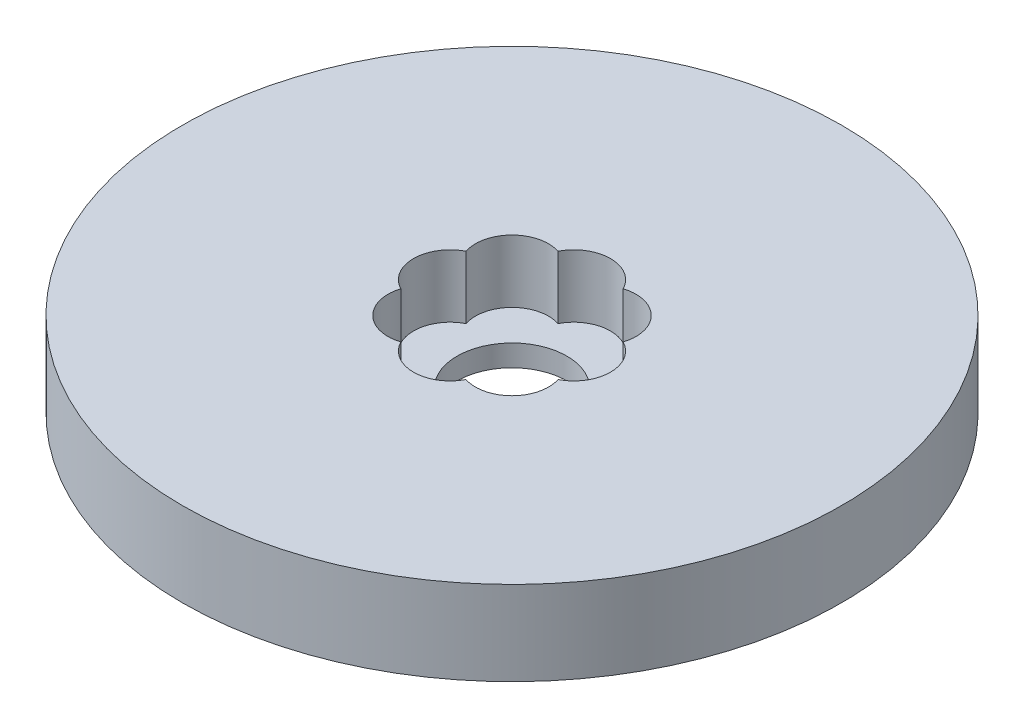
ISO-10303-21;
HEADER;
FILE_DESCRIPTION(('STEP AP214'),'2;1');
FILE_NAME('part.step','',(''),(''),'','','');
FILE_SCHEMA(('AUTOMOTIVE_DESIGN { 1 0 10303 214 1 1 1 1 }'));
ENDSEC;
DATA;
#1=APPLICATION_CONTEXT('core data for automotive mechanical design processes');
#2=APPLICATION_PROTOCOL_DEFINITION('international standard','automotive_design',2000,#1);
#3=PRODUCT_CONTEXT('',#1,'mechanical');
#4=PRODUCT('Part','Part','',(#3));
#5=PRODUCT_RELATED_PRODUCT_CATEGORY('part','',(#4));
#6=PRODUCT_DEFINITION_FORMATION('','',#4);
#7=PRODUCT_DEFINITION_CONTEXT('part definition',#1,'design');
#8=PRODUCT_DEFINITION('design','',#6,#7);
#9=PRODUCT_DEFINITION_SHAPE('','',#8);
#10=(LENGTH_UNIT() NAMED_UNIT(*) SI_UNIT(.MILLI.,.METRE.));
#11=(NAMED_UNIT(*) PLANE_ANGLE_UNIT() SI_UNIT($,.RADIAN.));
#12=(NAMED_UNIT(*) SI_UNIT($,.STERADIAN.) SOLID_ANGLE_UNIT());
#13=UNCERTAINTY_MEASURE_WITH_UNIT(LENGTH_MEASURE(1.E-05),#10,'distance_accuracy_value','');
#14=(GEOMETRIC_REPRESENTATION_CONTEXT(3) GLOBAL_UNCERTAINTY_ASSIGNED_CONTEXT((#13)) GLOBAL_UNIT_ASSIGNED_CONTEXT((#10,
#11,#12)) REPRESENTATION_CONTEXT('',''));
#15=CARTESIAN_POINT('',(0.,0.,0.));
#16=DIRECTION('',(0.,0.,1.));
#17=DIRECTION('',(1.,0.,0.));
#18=AXIS2_PLACEMENT_3D('',#15,#16,#17);
#19=CARTESIAN_POINT('',(0.,23.,0.));
#20=DIRECTION('',(0.,-1.,0.));
#21=DIRECTION('',(0.,0.,-1.));
#22=AXIS2_PLACEMENT_3D('',#19,#20,#21);
#23=CYLINDRICAL_SURFACE('',#22,15.);
#24=CARTESIAN_POINT('',(0.,0.,0.));
#25=DIRECTION('',(0.,1.,0.));
#26=DIRECTION('',(0.,0.,1.));
#27=AXIS2_PLACEMENT_3D('',#24,#25,#26);
#28=CIRCLE('',#27,15.);
#29=CARTESIAN_POINT('',(0.,0.,15.));
#30=VERTEX_POINT('',#29);
#31=EDGE_CURVE('E166',#30,#30,#28,.T.);
#32=ORIENTED_EDGE('',*,*,#31,.F.);
#33=EDGE_LOOP('',(#32));
#34=FACE_BOUND('',#33,.T.);
#35=CARTESIAN_POINT('',(0.,5.8732520530941,0.));
#36=DIRECTION('',(0.,1.,0.));
#37=DIRECTION('',(0.,0.,1.));
#38=AXIS2_PLACEMENT_3D('',#35,#36,#37);
#39=CIRCLE('',#38,15.);
#40=CARTESIAN_POINT('',(0.,5.8732520530941,15.));
#41=VERTEX_POINT('',#40);
#42=EDGE_CURVE('E11',#41,#41,#39,.T.);
#43=ORIENTED_EDGE('',*,*,#42,.T.);
#44=EDGE_LOOP('',(#43));
#45=FACE_BOUND('',#44,.T.);
#46=ADVANCED_FACE('F39',(#34,#45),#23,.F.);
#47=CARTESIAN_POINT('',(0.,23.,0.));
#48=DIRECTION('',(0.,-1.,0.));
#49=DIRECTION('',(0.,0.,-1.));
#50=AXIS2_PLACEMENT_3D('',#47,#48,#49);
#51=CYLINDRICAL_SURFACE('',#50,90.);
#52=CARTESIAN_POINT('',(0.,23.,0.));
#53=DIRECTION('',(0.,1.,0.));
#54=DIRECTION('',(0.,0.,1.));
#55=AXIS2_PLACEMENT_3D('',#52,#53,#54);
#56=CIRCLE('',#55,90.);
#57=CARTESIAN_POINT('',(0.,23.,90.));
#58=VERTEX_POINT('',#57);
#59=EDGE_CURVE('E50',#58,#58,#56,.T.);
#60=ORIENTED_EDGE('',*,*,#59,.F.);
#61=EDGE_LOOP('',(#60));
#62=FACE_BOUND('',#61,.T.);
#63=CARTESIAN_POINT('',(0.,0.,0.));
#64=DIRECTION('',(0.,1.,0.));
#65=DIRECTION('',(0.,0.,1.));
#66=AXIS2_PLACEMENT_3D('',#63,#64,#65);
#67=CIRCLE('',#66,90.);
#68=CARTESIAN_POINT('',(0.,0.,90.));
#69=VERTEX_POINT('',#68);
#70=EDGE_CURVE('E173',#69,#69,#67,.T.);
#71=ORIENTED_EDGE('',*,*,#70,.T.);
#72=EDGE_LOOP('',(#71));
#73=FACE_BOUND('',#72,.T.);
#74=ADVANCED_FACE('F41',(#62,#73),#51,.T.);
#75=CARTESIAN_POINT('',(0.,23.,0.));
#76=DIRECTION('',(0.,1.,0.));
#77=DIRECTION('',(0.,0.,1.));
#78=AXIS2_PLACEMENT_3D('',#75,#76,#77);
#79=PLANE('',#78);
#80=CARTESIAN_POINT('',(-11.9429057478669,23.,11.9429057478669));
#81=DIRECTION('',(0.,1.,0.));
#82=DIRECTION('',(0.707106781186549,0.,0.707106781186546));
#83=AXIS2_PLACEMENT_3D('',#80,#81,#82);
#84=CIRCLE('',#83,10.);
#85=CARTESIAN_POINT('',(-21.4659787909584,23.,8.89149954482822));
#86=VERTEX_POINT('',#85);
#87=CARTESIAN_POINT('',(-8.89149954482815,23.,21.4659787909585));
#88=VERTEX_POINT('',#87);
#89=EDGE_CURVE('E159',#86,#88,#84,.T.);
#90=ORIENTED_EDGE('',*,*,#89,.F.);
#91=CARTESIAN_POINT('',(-16.889819282777,23.,0.));
#92=DIRECTION('',(0.,1.,0.));
#93=DIRECTION('',(0.,0.,1.));
#94=AXIS2_PLACEMENT_3D('',#91,#92,#93);
#95=CIRCLE('',#94,10.);
#96=CARTESIAN_POINT('',(-21.4659787909586,23.,-8.89149954482813));
#97=VERTEX_POINT('',#96);
#98=EDGE_CURVE('E167',#97,#86,#95,.T.);
#99=ORIENTED_EDGE('',*,*,#98,.F.);
#100=CARTESIAN_POINT('',(-11.9429057478671,23.,-11.9429057478668));
#101=DIRECTION('',(0.,1.,0.));
#102=DIRECTION('',(-0.707106781186539,0.,0.707106781186556));
#103=AXIS2_PLACEMENT_3D('',#100,#101,#102);
#104=CIRCLE('',#103,10.);
#105=CARTESIAN_POINT('',(-8.89149954482845,23.,-21.4659787909584));
#106=VERTEX_POINT('',#105);
#107=EDGE_CURVE('E53',#106,#97,#104,.T.);
#108=ORIENTED_EDGE('',*,*,#107,.F.);
#109=CARTESIAN_POINT('',(-1.76911466526746E-13,23.,-16.889819282777));
#110=DIRECTION('',(0.,1.,0.));
#111=DIRECTION('',(-1.,0.,0.));
#112=AXIS2_PLACEMENT_3D('',#109,#110,#111);
#113=CIRCLE('',#112,10.);
#114=CARTESIAN_POINT('',(8.891499544828,23.,-21.4659787909585));
#115=VERTEX_POINT('',#114);
#116=EDGE_CURVE('E117',#115,#106,#113,.T.);
#117=ORIENTED_EDGE('',*,*,#116,.F.);
#118=CARTESIAN_POINT('',(11.9429057478668,23.,-11.942905747867));
#119=DIRECTION('',(0.,1.,0.));
#120=DIRECTION('',(-0.707106781186554,0.,-0.707106781186541));
#121=AXIS2_PLACEMENT_3D('',#118,#119,#120);
#122=CIRCLE('',#121,10.);
#123=CARTESIAN_POINT('',(21.4659787909584,23.,-8.89149954482827));
#124=VERTEX_POINT('',#123);
#125=EDGE_CURVE('E120',#124,#115,#122,.T.);
#126=ORIENTED_EDGE('',*,*,#125,.F.);
#127=CARTESIAN_POINT('',(16.889819282777,23.,0.));
#128=DIRECTION('',(0.,1.,0.));
#129=DIRECTION('',(0.,0.,-1.));
#130=AXIS2_PLACEMENT_3D('',#127,#128,#129);
#131=CIRCLE('',#130,10.);
#132=CARTESIAN_POINT('',(21.4659787909585,23.,8.89149954482818));
#133=VERTEX_POINT('',#132);
#134=EDGE_CURVE('E136',#133,#124,#131,.T.);
#135=ORIENTED_EDGE('',*,*,#134,.F.);
#136=CARTESIAN_POINT('',(11.942905747867,23.,11.9429057478669));
#137=DIRECTION('',(0.,1.,0.));
#138=DIRECTION('',(0.707106781186544,0.,-0.707106781186551));
#139=AXIS2_PLACEMENT_3D('',#136,#137,#138);
#140=CIRCLE('',#139,10.);
#141=CARTESIAN_POINT('',(8.8914995448283,23.,21.4659787909584));
#142=VERTEX_POINT('',#141);
#143=EDGE_CURVE('E138',#142,#133,#140,.T.);
#144=ORIENTED_EDGE('',*,*,#143,.F.);
#145=CARTESIAN_POINT('',(0.,23.,16.889819282777));
#146=DIRECTION('',(0.,1.,0.));
#147=DIRECTION('',(1.,0.,0.));
#148=AXIS2_PLACEMENT_3D('',#145,#146,#147);
#149=CIRCLE('',#148,10.);
#150=EDGE_CURVE('E146',#88,#142,#149,.T.);
#151=ORIENTED_EDGE('',*,*,#150,.F.);
#152=EDGE_LOOP('',(#90,#99,#108,#117,#126,#135,#144,#151));
#153=FACE_BOUND('',#152,.T.);
#154=ORIENTED_EDGE('',*,*,#59,.T.);
#155=EDGE_LOOP('',(#154));
#156=FACE_BOUND('',#155,.T.);
#157=ADVANCED_FACE('F181',(#153,#156),#79,.T.);
#158=CARTESIAN_POINT('',(0.,0.,0.));
#159=DIRECTION('',(0.,1.,0.));
#160=DIRECTION('',(0.,0.,1.));
#161=AXIS2_PLACEMENT_3D('',#158,#159,#160);
#162=PLANE('',#161);
#163=ORIENTED_EDGE('',*,*,#31,.T.);
#164=EDGE_LOOP('',(#163));
#165=FACE_BOUND('',#164,.T.);
#166=ORIENTED_EDGE('',*,*,#70,.F.);
#167=EDGE_LOOP('',(#166));
#168=FACE_BOUND('',#167,.T.);
#169=ADVANCED_FACE('F179',(#165,#168),#162,.F.);
#170=CARTESIAN_POINT('',(-16.889819282777,5.8732520530941,0.));
#171=DIRECTION('',(0.,1.,0.));
#172=DIRECTION('',(0.,0.,1.));
#173=AXIS2_PLACEMENT_3D('',#170,#171,#172);
#174=CYLINDRICAL_SURFACE('',#173,10.);
#175=ORIENTED_EDGE('',*,*,#98,.T.);
#176=DIRECTION('',(0.,1.,0.));
#177=VECTOR('',#176,1.);
#178=CARTESIAN_POINT('',(-21.4659787909584,14.4366260265471,8.89149954482822));
#179=LINE('',#178,#177);
#180=CARTESIAN_POINT('',(-21.4659787909584,5.8732520530941,8.89149954482822));
#181=VERTEX_POINT('',#180);
#182=EDGE_CURVE('E65',#86,#181,#179,.F.);
#183=ORIENTED_EDGE('',*,*,#182,.T.);
#184=CARTESIAN_POINT('',(-16.889819282777,5.8732520530941,0.));
#185=DIRECTION('',(0.,1.,0.));
#186=DIRECTION('',(0.,0.,1.));
#187=AXIS2_PLACEMENT_3D('',#184,#185,#186);
#188=CIRCLE('',#187,10.);
#189=CARTESIAN_POINT('',(-21.4659787909586,5.8732520530941,-8.89149954482813));
#190=VERTEX_POINT('',#189);
#191=EDGE_CURVE('E170',#190,#181,#188,.T.);
#192=ORIENTED_EDGE('',*,*,#191,.F.);
#193=DIRECTION('',(0.,1.,0.));
#194=VECTOR('',#193,1.);
#195=CARTESIAN_POINT('',(-21.4659787909586,14.4366260265471,-8.89149954482813));
#196=LINE('',#195,#194);
#197=EDGE_CURVE('E124',#190,#97,#196,.T.);
#198=ORIENTED_EDGE('',*,*,#197,.T.);
#199=EDGE_LOOP('',(#175,#183,#192,#198));
#200=FACE_BOUND('',#199,.T.);
#201=ADVANCED_FACE('F185',(#200),#174,.F.);
#202=CARTESIAN_POINT('',(-16.889819282777,5.8732520530941,0.));
#203=DIRECTION('',(0.,1.,0.));
#204=DIRECTION('',(0.,0.,1.));
#205=AXIS2_PLACEMENT_3D('',#202,#203,#204);
#206=PLANE('',#205);
#207=ORIENTED_EDGE('',*,*,#191,.T.);
#208=CARTESIAN_POINT('',(-11.9429057478669,5.8732520530941,11.9429057478669));
#209=DIRECTION('',(0.,1.,0.));
#210=DIRECTION('',(0.707106781186549,0.,0.707106781186546));
#211=AXIS2_PLACEMENT_3D('',#208,#209,#210);
#212=CIRCLE('',#211,10.);
#213=CARTESIAN_POINT('',(-8.89149954482815,5.8732520530941,21.4659787909585));
#214=VERTEX_POINT('',#213);
#215=EDGE_CURVE('E161',#181,#214,#212,.T.);
#216=ORIENTED_EDGE('',*,*,#215,.T.);
#217=CARTESIAN_POINT('',(0.,5.8732520530941,16.889819282777));
#218=DIRECTION('',(0.,1.,0.));
#219=DIRECTION('',(1.,0.,0.));
#220=AXIS2_PLACEMENT_3D('',#217,#218,#219);
#221=CIRCLE('',#220,10.);
#222=CARTESIAN_POINT('',(8.8914995448283,5.8732520530941,21.4659787909584));
#223=VERTEX_POINT('',#222);
#224=EDGE_CURVE('E149',#214,#223,#221,.T.);
#225=ORIENTED_EDGE('',*,*,#224,.T.);
#226=CARTESIAN_POINT('',(11.942905747867,5.8732520530941,11.9429057478669));
#227=DIRECTION('',(0.,1.,0.));
#228=DIRECTION('',(0.707106781186544,0.,-0.707106781186551));
#229=AXIS2_PLACEMENT_3D('',#226,#227,#228);
#230=CIRCLE('',#229,10.);
#231=CARTESIAN_POINT('',(21.4659787909585,5.8732520530941,8.89149954482818));
#232=VERTEX_POINT('',#231);
#233=EDGE_CURVE('E143',#223,#232,#230,.T.);
#234=ORIENTED_EDGE('',*,*,#233,.T.);
#235=CARTESIAN_POINT('',(16.889819282777,5.8732520530941,0.));
#236=DIRECTION('',(0.,1.,0.));
#237=DIRECTION('',(0.,0.,-1.));
#238=AXIS2_PLACEMENT_3D('',#235,#236,#237);
#239=CIRCLE('',#238,10.);
#240=CARTESIAN_POINT('',(21.4659787909584,5.8732520530941,-8.89149954482827));
#241=VERTEX_POINT('',#240);
#242=EDGE_CURVE('E140',#232,#241,#239,.T.);
#243=ORIENTED_EDGE('',*,*,#242,.T.);
#244=CARTESIAN_POINT('',(11.9429057478668,5.8732520530941,-11.942905747867));
#245=DIRECTION('',(0.,1.,0.));
#246=DIRECTION('',(-0.707106781186554,0.,-0.707106781186541));
#247=AXIS2_PLACEMENT_3D('',#244,#245,#246);
#248=CIRCLE('',#247,10.);
#249=CARTESIAN_POINT('',(8.891499544828,5.8732520530941,-21.4659787909585));
#250=VERTEX_POINT('',#249);
#251=EDGE_CURVE('E111',#241,#250,#248,.T.);
#252=ORIENTED_EDGE('',*,*,#251,.T.);
#253=CARTESIAN_POINT('',(-1.76911466526746E-13,5.8732520530941,-16.889819282777));
#254=DIRECTION('',(0.,1.,0.));
#255=DIRECTION('',(-1.,0.,0.));
#256=AXIS2_PLACEMENT_3D('',#253,#254,#255);
#257=CIRCLE('',#256,10.);
#258=CARTESIAN_POINT('',(-8.89149954482845,5.8732520530941,-21.4659787909584));
#259=VERTEX_POINT('',#258);
#260=EDGE_CURVE('E104',#250,#259,#257,.T.);
#261=ORIENTED_EDGE('',*,*,#260,.T.);
#262=CARTESIAN_POINT('',(-11.9429057478671,5.8732520530941,-11.9429057478668));
#263=DIRECTION('',(0.,1.,0.));
#264=DIRECTION('',(-0.707106781186539,0.,0.707106781186556));
#265=AXIS2_PLACEMENT_3D('',#262,#263,#264);
#266=CIRCLE('',#265,10.);
#267=EDGE_CURVE('E112',#259,#190,#266,.T.);
#268=ORIENTED_EDGE('',*,*,#267,.T.);
#269=EDGE_LOOP('',(#207,#216,#225,#234,#243,#252,#261,#268));
#270=FACE_BOUND('',#269,.T.);
#271=ORIENTED_EDGE('',*,*,#42,.F.);
#272=EDGE_LOOP('',(#271));
#273=FACE_BOUND('',#272,.T.);
#274=ADVANCED_FACE('F107',(#270,#273),#206,.T.);
#275=CARTESIAN_POINT('',(-11.9429057478669,5.8732520530941,11.9429057478669));
#276=DIRECTION('',(0.,1.,0.));
#277=DIRECTION('',(0.,0.,1.));
#278=AXIS2_PLACEMENT_3D('',#275,#276,#277);
#279=CYLINDRICAL_SURFACE('',#278,10.);
#280=ORIENTED_EDGE('',*,*,#89,.T.);
#281=DIRECTION('',(0.,1.,0.));
#282=VECTOR('',#281,1.);
#283=CARTESIAN_POINT('',(-8.89149954482815,14.4366260265471,21.4659787909585));
#284=LINE('',#283,#282);
#285=EDGE_CURVE('E160',#88,#214,#284,.F.);
#286=ORIENTED_EDGE('',*,*,#285,.T.);
#287=ORIENTED_EDGE('',*,*,#215,.F.);
#288=ORIENTED_EDGE('',*,*,#182,.F.);
#289=EDGE_LOOP('',(#280,#286,#287,#288));
#290=FACE_BOUND('',#289,.T.);
#291=ADVANCED_FACE('F202',(#290),#279,.F.);
#292=CARTESIAN_POINT('',(-11.9429057478671,5.8732520530941,-11.9429057478668));
#293=DIRECTION('',(0.,1.,0.));
#294=DIRECTION('',(0.,0.,1.));
#295=AXIS2_PLACEMENT_3D('',#292,#293,#294);
#296=CYLINDRICAL_SURFACE('',#295,10.);
#297=ORIENTED_EDGE('',*,*,#267,.F.);
#298=DIRECTION('',(0.,1.,0.));
#299=VECTOR('',#298,1.);
#300=CARTESIAN_POINT('',(-8.89149954482845,14.4366260265471,-21.4659787909584));
#301=LINE('',#300,#299);
#302=EDGE_CURVE('E119',#106,#259,#301,.F.);
#303=ORIENTED_EDGE('',*,*,#302,.F.);
#304=ORIENTED_EDGE('',*,*,#107,.T.);
#305=ORIENTED_EDGE('',*,*,#197,.F.);
#306=EDGE_LOOP('',(#297,#303,#304,#305));
#307=FACE_BOUND('',#306,.T.);
#308=ADVANCED_FACE('F123',(#307),#296,.F.);
#309=CARTESIAN_POINT('',(0.,5.8732520530941,16.889819282777));
#310=DIRECTION('',(0.,1.,0.));
#311=DIRECTION('',(0.,0.,1.));
#312=AXIS2_PLACEMENT_3D('',#309,#310,#311);
#313=CYLINDRICAL_SURFACE('',#312,10.);
#314=ORIENTED_EDGE('',*,*,#150,.T.);
#315=DIRECTION('',(0.,1.,0.));
#316=VECTOR('',#315,1.);
#317=CARTESIAN_POINT('',(8.8914995448283,14.4366260265471,21.4659787909584));
#318=LINE('',#317,#316);
#319=EDGE_CURVE('E141',#142,#223,#318,.F.);
#320=ORIENTED_EDGE('',*,*,#319,.T.);
#321=ORIENTED_EDGE('',*,*,#224,.F.);
#322=ORIENTED_EDGE('',*,*,#285,.F.);
#323=EDGE_LOOP('',(#314,#320,#321,#322));
#324=FACE_BOUND('',#323,.T.);
#325=ADVANCED_FACE('F208',(#324),#313,.F.);
#326=CARTESIAN_POINT('',(11.942905747867,5.8732520530941,11.9429057478669));
#327=DIRECTION('',(0.,1.,0.));
#328=DIRECTION('',(0.,0.,1.));
#329=AXIS2_PLACEMENT_3D('',#326,#327,#328);
#330=CYLINDRICAL_SURFACE('',#329,10.);
#331=DIRECTION('',(0.,1.,0.));
#332=VECTOR('',#331,1.);
#333=CARTESIAN_POINT('',(21.4659787909585,14.4366260265471,8.89149954482818));
#334=LINE('',#333,#332);
#335=EDGE_CURVE('E151',#133,#232,#334,.F.);
#336=ORIENTED_EDGE('',*,*,#335,.T.);
#337=ORIENTED_EDGE('',*,*,#233,.F.);
#338=ORIENTED_EDGE('',*,*,#319,.F.);
#339=ORIENTED_EDGE('',*,*,#143,.T.);
#340=EDGE_LOOP('',(#336,#337,#338,#339));
#341=FACE_BOUND('',#340,.T.);
#342=ADVANCED_FACE('F211',(#341),#330,.F.);
#343=CARTESIAN_POINT('',(16.889819282777,5.8732520530941,0.));
#344=DIRECTION('',(0.,1.,0.));
#345=DIRECTION('',(0.,0.,1.));
#346=AXIS2_PLACEMENT_3D('',#343,#344,#345);
#347=CYLINDRICAL_SURFACE('',#346,10.);
#348=ORIENTED_EDGE('',*,*,#134,.T.);
#349=DIRECTION('',(0.,1.,0.));
#350=VECTOR('',#349,1.);
#351=CARTESIAN_POINT('',(21.4659787909584,14.4366260265471,-8.89149954482827));
#352=LINE('',#351,#350);
#353=EDGE_CURVE('E131',#124,#241,#352,.F.);
#354=ORIENTED_EDGE('',*,*,#353,.T.);
#355=ORIENTED_EDGE('',*,*,#242,.F.);
#356=ORIENTED_EDGE('',*,*,#335,.F.);
#357=EDGE_LOOP('',(#348,#354,#355,#356));
#358=FACE_BOUND('',#357,.T.);
#359=ADVANCED_FACE('F214',(#358),#347,.F.);
#360=CARTESIAN_POINT('',(11.9429057478668,5.8732520530941,-11.942905747867));
#361=DIRECTION('',(0.,1.,0.));
#362=DIRECTION('',(0.,0.,1.));
#363=AXIS2_PLACEMENT_3D('',#360,#361,#362);
#364=CYLINDRICAL_SURFACE('',#363,10.);
#365=DIRECTION('',(0.,1.,0.));
#366=VECTOR('',#365,1.);
#367=CARTESIAN_POINT('',(8.891499544828,14.4366260265471,-21.4659787909585));
#368=LINE('',#367,#366);
#369=EDGE_CURVE('E154',#115,#250,#368,.F.);
#370=ORIENTED_EDGE('',*,*,#369,.T.);
#371=ORIENTED_EDGE('',*,*,#251,.F.);
#372=ORIENTED_EDGE('',*,*,#353,.F.);
#373=ORIENTED_EDGE('',*,*,#125,.T.);
#374=EDGE_LOOP('',(#370,#371,#372,#373));
#375=FACE_BOUND('',#374,.T.);
#376=ADVANCED_FACE('F218',(#375),#364,.F.);
#377=CARTESIAN_POINT('',(-1.76911466526746E-13,5.8732520530941,-16.889819282777));
#378=DIRECTION('',(0.,1.,0.));
#379=DIRECTION('',(0.,0.,1.));
#380=AXIS2_PLACEMENT_3D('',#377,#378,#379);
#381=CYLINDRICAL_SURFACE('',#380,10.);
#382=ORIENTED_EDGE('',*,*,#116,.T.);
#383=ORIENTED_EDGE('',*,*,#302,.T.);
#384=ORIENTED_EDGE('',*,*,#260,.F.);
#385=ORIENTED_EDGE('',*,*,#369,.F.);
#386=EDGE_LOOP('',(#382,#383,#384,#385));
#387=FACE_BOUND('',#386,.T.);
#388=ADVANCED_FACE('F121',(#387),#381,.F.);
#389=CLOSED_SHELL('',(#46,#74,#157,#169,#201,#274,#291,#308,#325,#342,#359,#376,#388));
#390=MANIFOLD_SOLID_BREP('B2',#389);
#391=ADVANCED_BREP_SHAPE_REPRESENTATION('',(#18,#390),#14);
#392=SHAPE_DEFINITION_REPRESENTATION(#9,#391);
ENDSEC;
END-ISO-10303-21;
